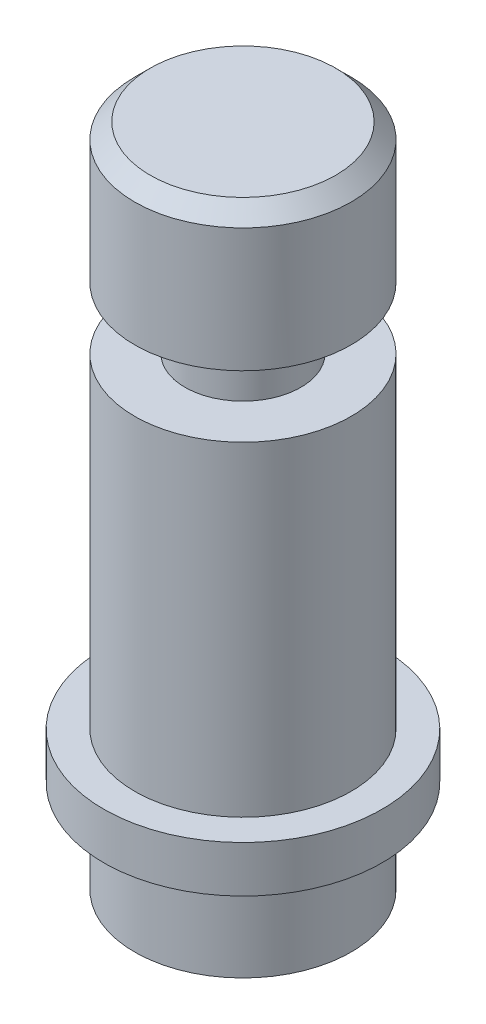
ISO-10303-21;
HEADER;
FILE_DESCRIPTION(('STEP AP214'),'2;1');
FILE_NAME('part.step','',(''),(''),'','','');
FILE_SCHEMA(('AUTOMOTIVE_DESIGN { 1 0 10303 214 1 1 1 1 }'));
ENDSEC;
DATA;
#1=APPLICATION_CONTEXT('core data for automotive mechanical design processes');
#2=APPLICATION_PROTOCOL_DEFINITION('international standard','automotive_design',2000,#1);
#3=PRODUCT_CONTEXT('',#1,'mechanical');
#4=PRODUCT('Part','Part','',(#3));
#5=PRODUCT_RELATED_PRODUCT_CATEGORY('part','',(#4));
#6=PRODUCT_DEFINITION_FORMATION('','',#4);
#7=PRODUCT_DEFINITION_CONTEXT('part definition',#1,'design');
#8=PRODUCT_DEFINITION('design','',#6,#7);
#9=PRODUCT_DEFINITION_SHAPE('','',#8);
#10=(LENGTH_UNIT() NAMED_UNIT(*) SI_UNIT(.MILLI.,.METRE.));
#11=(NAMED_UNIT(*) PLANE_ANGLE_UNIT() SI_UNIT($,.RADIAN.));
#12=(NAMED_UNIT(*) SI_UNIT($,.STERADIAN.) SOLID_ANGLE_UNIT());
#13=UNCERTAINTY_MEASURE_WITH_UNIT(LENGTH_MEASURE(1.E-05),#10,'distance_accuracy_value','');
#14=(GEOMETRIC_REPRESENTATION_CONTEXT(3) GLOBAL_UNCERTAINTY_ASSIGNED_CONTEXT((#13)) GLOBAL_UNIT_ASSIGNED_CONTEXT((#10,
#11,#12)) REPRESENTATION_CONTEXT('',''));
#15=CARTESIAN_POINT('',(0.,0.,0.));
#16=DIRECTION('',(0.,0.,1.));
#17=DIRECTION('',(1.,0.,0.));
#18=AXIS2_PLACEMENT_3D('',#15,#16,#17);
#19=CARTESIAN_POINT('',(0.,0.,0.));
#20=DIRECTION('',(0.,1.,0.));
#21=DIRECTION('',(-1.,0.,0.));
#22=AXIS2_PLACEMENT_3D('',#19,#20,#21);
#23=PLANE('',#22);
#24=CARTESIAN_POINT('',(0.,0.,0.));
#25=DIRECTION('',(0.,1.,0.));
#26=DIRECTION('',(-1.,0.,0.));
#27=AXIS2_PLACEMENT_3D('',#24,#25,#26);
#28=CIRCLE('',#27,7.);
#29=CARTESIAN_POINT('',(-7.,0.,0.));
#30=VERTEX_POINT('',#29);
#31=EDGE_CURVE('E46',#30,#30,#28,.T.);
#32=ORIENTED_EDGE('',*,*,#31,.F.);
#33=EDGE_LOOP('',(#32));
#34=FACE_BOUND('',#33,.T.);
#35=ADVANCED_FACE('F35',(#34),#23,.F.);
#36=CARTESIAN_POINT('',(0.,43.,0.));
#37=DIRECTION('',(0.,1.,0.));
#38=DIRECTION('',(-1.,0.,0.));
#39=AXIS2_PLACEMENT_3D('',#36,#37,#38);
#40=CYLINDRICAL_SURFACE('',#39,7.);
#41=CARTESIAN_POINT('',(0.,5.99999999999999,0.));
#42=DIRECTION('',(0.,1.,0.));
#43=DIRECTION('',(-1.,0.,0.));
#44=AXIS2_PLACEMENT_3D('',#41,#42,#43);
#45=CIRCLE('',#44,7.);
#46=CARTESIAN_POINT('',(-7.,5.99999999999999,0.));
#47=VERTEX_POINT('',#46);
#48=EDGE_CURVE('E50',#47,#47,#45,.T.);
#49=ORIENTED_EDGE('',*,*,#48,.F.);
#50=EDGE_LOOP('',(#49));
#51=FACE_BOUND('',#50,.T.);
#52=ORIENTED_EDGE('',*,*,#31,.T.);
#53=EDGE_LOOP('',(#52));
#54=FACE_BOUND('',#53,.T.);
#55=ADVANCED_FACE('F118',(#51,#54),#40,.T.);
#56=CARTESIAN_POINT('',(7.,5.99999999999999,0.));
#57=DIRECTION('',(0.,1.,0.));
#58=DIRECTION('',(-1.,0.,0.));
#59=AXIS2_PLACEMENT_3D('',#56,#57,#58);
#60=PLANE('',#59);
#61=CARTESIAN_POINT('',(0.,5.99999999999999,0.));
#62=DIRECTION('',(0.,1.,0.));
#63=DIRECTION('',(-1.,0.,0.));
#64=AXIS2_PLACEMENT_3D('',#61,#62,#63);
#65=CIRCLE('',#64,9.);
#66=CARTESIAN_POINT('',(-9.,5.99999999999999,0.));
#67=VERTEX_POINT('',#66);
#68=EDGE_CURVE('E55',#67,#67,#65,.T.);
#69=ORIENTED_EDGE('',*,*,#68,.F.);
#70=EDGE_LOOP('',(#69));
#71=FACE_BOUND('',#70,.T.);
#72=ORIENTED_EDGE('',*,*,#48,.T.);
#73=EDGE_LOOP('',(#72));
#74=FACE_BOUND('',#73,.T.);
#75=ADVANCED_FACE('F112',(#71,#74),#60,.F.);
#76=CARTESIAN_POINT('',(0.,43.,0.));
#77=DIRECTION('',(0.,1.,0.));
#78=DIRECTION('',(-1.,0.,0.));
#79=AXIS2_PLACEMENT_3D('',#76,#77,#78);
#80=CYLINDRICAL_SURFACE('',#79,9.);
#81=CARTESIAN_POINT('',(0.,8.99999999999999,0.));
#82=DIRECTION('',(0.,1.,0.));
#83=DIRECTION('',(-1.,0.,0.));
#84=AXIS2_PLACEMENT_3D('',#81,#82,#83);
#85=CIRCLE('',#84,9.);
#86=CARTESIAN_POINT('',(-9.,8.99999999999999,0.));
#87=VERTEX_POINT('',#86);
#88=EDGE_CURVE('E58',#87,#87,#85,.T.);
#89=ORIENTED_EDGE('',*,*,#88,.F.);
#90=EDGE_LOOP('',(#89));
#91=FACE_BOUND('',#90,.T.);
#92=ORIENTED_EDGE('',*,*,#68,.T.);
#93=EDGE_LOOP('',(#92));
#94=FACE_BOUND('',#93,.T.);
#95=ADVANCED_FACE('F106',(#91,#94),#80,.T.);
#96=CARTESIAN_POINT('',(9.,8.99999999999999,0.));
#97=DIRECTION('',(0.,-1.,0.));
#98=DIRECTION('',(1.,0.,0.));
#99=AXIS2_PLACEMENT_3D('',#96,#97,#98);
#100=PLANE('',#99);
#101=CARTESIAN_POINT('',(0.,8.99999999999999,0.));
#102=DIRECTION('',(0.,1.,0.));
#103=DIRECTION('',(-1.,0.,0.));
#104=AXIS2_PLACEMENT_3D('',#101,#102,#103);
#105=CIRCLE('',#104,7.);
#106=CARTESIAN_POINT('',(-7.,8.99999999999999,0.));
#107=VERTEX_POINT('',#106);
#108=EDGE_CURVE('E61',#107,#107,#105,.T.);
#109=ORIENTED_EDGE('',*,*,#108,.F.);
#110=EDGE_LOOP('',(#109));
#111=FACE_BOUND('',#110,.T.);
#112=ORIENTED_EDGE('',*,*,#88,.T.);
#113=EDGE_LOOP('',(#112));
#114=FACE_BOUND('',#113,.T.);
#115=ADVANCED_FACE('F100',(#111,#114),#100,.F.);
#116=CARTESIAN_POINT('',(0.,43.,0.));
#117=DIRECTION('',(0.,1.,0.));
#118=DIRECTION('',(-1.,0.,0.));
#119=AXIS2_PLACEMENT_3D('',#116,#117,#118);
#120=CYLINDRICAL_SURFACE('',#119,7.);
#121=CARTESIAN_POINT('',(0.,30.,0.));
#122=DIRECTION('',(0.,1.,0.));
#123=DIRECTION('',(-1.,0.,0.));
#124=AXIS2_PLACEMENT_3D('',#121,#122,#123);
#125=CIRCLE('',#124,7.);
#126=CARTESIAN_POINT('',(-7.,30.,0.));
#127=VERTEX_POINT('',#126);
#128=EDGE_CURVE('E64',#127,#127,#125,.T.);
#129=ORIENTED_EDGE('',*,*,#128,.F.);
#130=EDGE_LOOP('',(#129));
#131=FACE_BOUND('',#130,.T.);
#132=ORIENTED_EDGE('',*,*,#108,.T.);
#133=EDGE_LOOP('',(#132));
#134=FACE_BOUND('',#133,.T.);
#135=ADVANCED_FACE('F94',(#131,#134),#120,.T.);
#136=CARTESIAN_POINT('',(7.,30.,0.));
#137=DIRECTION('',(0.,-1.,0.));
#138=DIRECTION('',(1.,0.,0.));
#139=AXIS2_PLACEMENT_3D('',#136,#137,#138);
#140=PLANE('',#139);
#141=CARTESIAN_POINT('',(0.,30.,0.));
#142=DIRECTION('',(0.,1.,0.));
#143=DIRECTION('',(-1.,0.,0.));
#144=AXIS2_PLACEMENT_3D('',#141,#142,#143);
#145=CIRCLE('',#144,3.75);
#146=CARTESIAN_POINT('',(-3.75,30.,0.));
#147=VERTEX_POINT('',#146);
#148=EDGE_CURVE('E67',#147,#147,#145,.T.);
#149=ORIENTED_EDGE('',*,*,#148,.F.);
#150=EDGE_LOOP('',(#149));
#151=FACE_BOUND('',#150,.T.);
#152=ORIENTED_EDGE('',*,*,#128,.T.);
#153=EDGE_LOOP('',(#152));
#154=FACE_BOUND('',#153,.T.);
#155=ADVANCED_FACE('F88',(#151,#154),#140,.F.);
#156=CARTESIAN_POINT('',(0.,43.,0.));
#157=DIRECTION('',(0.,1.,0.));
#158=DIRECTION('',(-1.,0.,0.));
#159=AXIS2_PLACEMENT_3D('',#156,#157,#158);
#160=CYLINDRICAL_SURFACE('',#159,3.75);
#161=CARTESIAN_POINT('',(0.,34.,0.));
#162=DIRECTION('',(0.,1.,0.));
#163=DIRECTION('',(-1.,0.,0.));
#164=AXIS2_PLACEMENT_3D('',#161,#162,#163);
#165=CIRCLE('',#164,3.75);
#166=CARTESIAN_POINT('',(-3.75000000000001,34.,0.));
#167=VERTEX_POINT('',#166);
#168=EDGE_CURVE('E70',#167,#167,#165,.T.);
#169=ORIENTED_EDGE('',*,*,#168,.F.);
#170=EDGE_LOOP('',(#169));
#171=FACE_BOUND('',#170,.T.);
#172=ORIENTED_EDGE('',*,*,#148,.T.);
#173=EDGE_LOOP('',(#172));
#174=FACE_BOUND('',#173,.T.);
#175=ADVANCED_FACE('F82',(#171,#174),#160,.T.);
#176=CARTESIAN_POINT('',(3.75,34.,0.));
#177=DIRECTION('',(0.,1.,0.));
#178=DIRECTION('',(-1.,0.,0.));
#179=AXIS2_PLACEMENT_3D('',#176,#177,#178);
#180=PLANE('',#179);
#181=CARTESIAN_POINT('',(0.,34.,0.));
#182=DIRECTION('',(0.,1.,0.));
#183=DIRECTION('',(-1.,0.,0.));
#184=AXIS2_PLACEMENT_3D('',#181,#182,#183);
#185=CIRCLE('',#184,7.);
#186=CARTESIAN_POINT('',(-7.,34.,0.));
#187=VERTEX_POINT('',#186);
#188=EDGE_CURVE('E73',#187,#187,#185,.T.);
#189=ORIENTED_EDGE('',*,*,#188,.F.);
#190=EDGE_LOOP('',(#189));
#191=FACE_BOUND('',#190,.T.);
#192=ORIENTED_EDGE('',*,*,#168,.T.);
#193=EDGE_LOOP('',(#192));
#194=FACE_BOUND('',#193,.T.);
#195=ADVANCED_FACE('F79',(#191,#194),#180,.F.);
#196=CARTESIAN_POINT('',(0.,43.,0.));
#197=DIRECTION('',(0.,1.,0.));
#198=DIRECTION('',(-1.,0.,0.));
#199=AXIS2_PLACEMENT_3D('',#196,#197,#198);
#200=CYLINDRICAL_SURFACE('',#199,7.);
#201=CARTESIAN_POINT('',(0.,42.,0.));
#202=DIRECTION('',(0.,-1.,0.));
#203=DIRECTION('',(1.,0.,0.));
#204=AXIS2_PLACEMENT_3D('',#201,#202,#203);
#205=CIRCLE('',#204,7.);
#206=CARTESIAN_POINT('',(7.,42.,0.));
#207=VERTEX_POINT('',#206);
#208=EDGE_CURVE('E10',#207,#207,#205,.T.);
#209=ORIENTED_EDGE('',*,*,#208,.T.);
#210=EDGE_LOOP('',(#209));
#211=FACE_BOUND('',#210,.T.);
#212=ORIENTED_EDGE('',*,*,#188,.T.);
#213=EDGE_LOOP('',(#212));
#214=FACE_BOUND('',#213,.T.);
#215=ADVANCED_FACE('F77',(#211,#214),#200,.T.);
#216=CARTESIAN_POINT('',(7.,43.,0.));
#217=DIRECTION('',(0.,-1.,0.));
#218=DIRECTION('',(1.,0.,0.));
#219=AXIS2_PLACEMENT_3D('',#216,#217,#218);
#220=PLANE('',#219);
#221=CARTESIAN_POINT('',(0.,43.,0.));
#222=DIRECTION('',(0.,-1.,0.));
#223=DIRECTION('',(1.,0.,0.));
#224=AXIS2_PLACEMENT_3D('',#221,#222,#223);
#225=CIRCLE('',#224,6.00000000000001);
#226=CARTESIAN_POINT('',(6.,43.,0.));
#227=VERTEX_POINT('',#226);
#228=EDGE_CURVE('E42',#227,#227,#225,.F.);
#229=ORIENTED_EDGE('',*,*,#228,.T.);
#230=EDGE_LOOP('',(#229));
#231=FACE_BOUND('',#230,.T.);
#232=ADVANCED_FACE('F133',(#231),#220,.F.);
#233=CARTESIAN_POINT('',(0.,43.,0.));
#234=DIRECTION('',(0.,-1.,0.));
#235=DIRECTION('',(1.,0.,0.));
#236=AXIS2_PLACEMENT_3D('',#233,#234,#235);
#237=CONICAL_SURFACE('',#236,6.00000000000001,0.785398163397446);
#238=ORIENTED_EDGE('',*,*,#208,.F.);
#239=EDGE_LOOP('',(#238));
#240=FACE_BOUND('',#239,.T.);
#241=ORIENTED_EDGE('',*,*,#228,.F.);
#242=EDGE_LOOP('',(#241));
#243=FACE_BOUND('',#242,.T.);
#244=ADVANCED_FACE('F37',(#240,#243),#237,.T.);
#245=CLOSED_SHELL('',(#35,#55,#75,#95,#115,#135,#155,#175,#195,#215,#232,#244));
#246=MANIFOLD_SOLID_BREP('B2',#245);
#247=ADVANCED_BREP_SHAPE_REPRESENTATION('',(#18,#246),#14);
#248=SHAPE_DEFINITION_REPRESENTATION(#9,#247);
ENDSEC;
END-ISO-10303-21;
